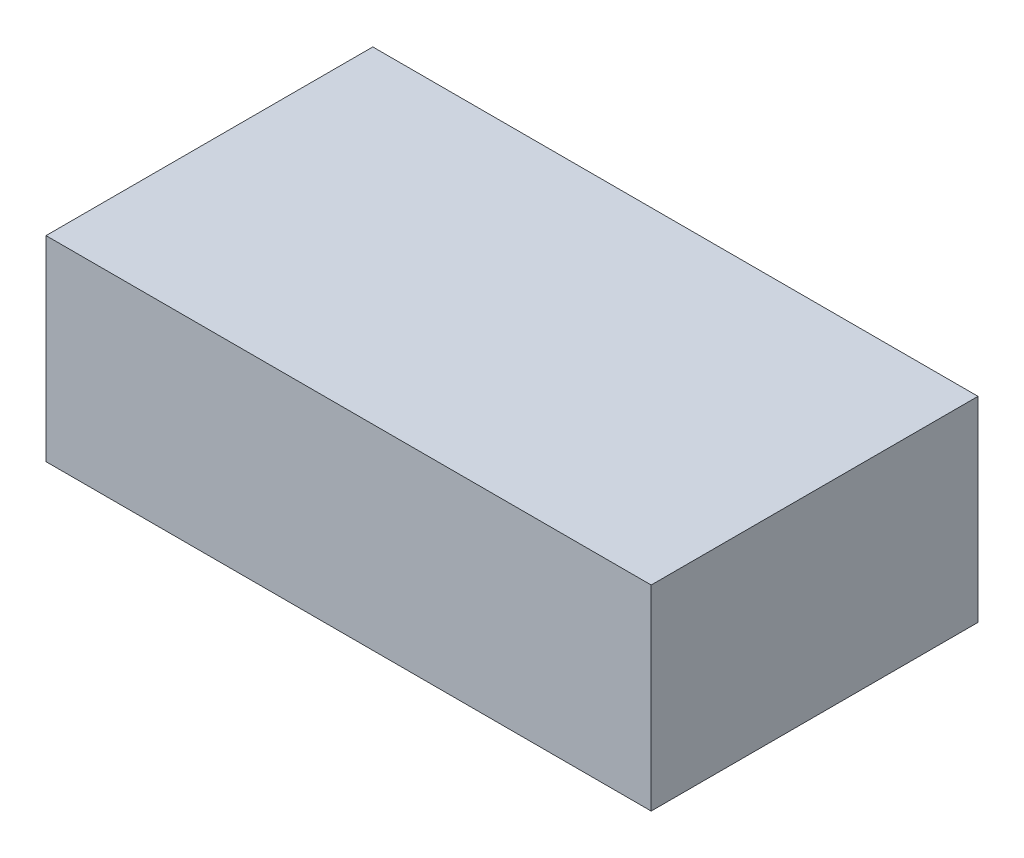
ISO-10303-21;
HEADER;
FILE_DESCRIPTION(('STEP AP214'),'2;1');
FILE_NAME('part.step','',(''),(''),'','','');
FILE_SCHEMA(('AUTOMOTIVE_DESIGN { 1 0 10303 214 1 1 1 1 }'));
ENDSEC;
DATA;
#1=APPLICATION_CONTEXT('core data for automotive mechanical design processes');
#2=APPLICATION_PROTOCOL_DEFINITION('international standard','automotive_design',2000,#1);
#3=PRODUCT_CONTEXT('',#1,'mechanical');
#4=PRODUCT('Part','Part','',(#3));
#5=PRODUCT_RELATED_PRODUCT_CATEGORY('part','',(#4));
#6=PRODUCT_DEFINITION_FORMATION('','',#4);
#7=PRODUCT_DEFINITION_CONTEXT('part definition',#1,'design');
#8=PRODUCT_DEFINITION('design','',#6,#7);
#9=PRODUCT_DEFINITION_SHAPE('','',#8);
#10=(LENGTH_UNIT() NAMED_UNIT(*) SI_UNIT(.MILLI.,.METRE.));
#11=(NAMED_UNIT(*) PLANE_ANGLE_UNIT() SI_UNIT($,.RADIAN.));
#12=(NAMED_UNIT(*) SI_UNIT($,.STERADIAN.) SOLID_ANGLE_UNIT());
#13=UNCERTAINTY_MEASURE_WITH_UNIT(LENGTH_MEASURE(1.E-05),#10,'distance_accuracy_value','');
#14=(GEOMETRIC_REPRESENTATION_CONTEXT(3) GLOBAL_UNCERTAINTY_ASSIGNED_CONTEXT((#13)) GLOBAL_UNIT_ASSIGNED_CONTEXT((#10,
#11,#12)) REPRESENTATION_CONTEXT('',''));
#15=CARTESIAN_POINT('',(0.,0.,0.));
#16=DIRECTION('',(0.,0.,1.));
#17=DIRECTION('',(1.,0.,0.));
#18=AXIS2_PLACEMENT_3D('',#15,#16,#17);
#19=CARTESIAN_POINT('',(-0.42500042,0.13750036,0.45899832));
#20=DIRECTION('',(0.,0.,1.));
#21=DIRECTION('',(1.,0.,0.));
#22=AXIS2_PLACEMENT_3D('',#19,#20,#21);
#23=PLANE('',#22);
#24=DIRECTION('',(1.,0.,0.));
#25=VECTOR('',#24,1.);
#26=CARTESIAN_POINT('',(-0.42500042,0.13750036,0.45899832));
#27=LINE('',#26,#25);
#28=CARTESIAN_POINT('',(-0.42500042,0.13750036,0.45899832));
#29=VERTEX_POINT('',#28);
#30=CARTESIAN_POINT('',(0.42500042,0.13750036,0.45899832));
#31=VERTEX_POINT('',#30);
#32=EDGE_CURVE('E79',#29,#31,#27,.T.);
#33=ORIENTED_EDGE('',*,*,#32,.F.);
#34=DIRECTION('',(0.,1.,0.));
#35=VECTOR('',#34,1.);
#36=CARTESIAN_POINT('',(-0.42500042,-0.13750036,0.45899832));
#37=LINE('',#36,#35);
#38=CARTESIAN_POINT('',(-0.42500042,-0.13750036,0.45899832));
#39=VERTEX_POINT('',#38);
#40=EDGE_CURVE('E27',#39,#29,#37,.T.);
#41=ORIENTED_EDGE('',*,*,#40,.F.);
#42=DIRECTION('',(-1.,0.,0.));
#43=VECTOR('',#42,1.);
#44=CARTESIAN_POINT('',(0.42500042,-0.13750036,0.45899832));
#45=LINE('',#44,#43);
#46=CARTESIAN_POINT('',(0.42500042,-0.13750036,0.45899832));
#47=VERTEX_POINT('',#46);
#48=EDGE_CURVE('E101',#47,#39,#45,.T.);
#49=ORIENTED_EDGE('',*,*,#48,.F.);
#50=DIRECTION('',(0.,-1.,0.));
#51=VECTOR('',#50,1.);
#52=CARTESIAN_POINT('',(0.42500042,0.13750036,0.45899832));
#53=LINE('',#52,#51);
#54=EDGE_CURVE('E81',#31,#47,#53,.T.);
#55=ORIENTED_EDGE('',*,*,#54,.F.);
#56=EDGE_LOOP('',(#33,#41,#49,#55));
#57=FACE_BOUND('',#56,.T.);
#58=ADVANCED_FACE('F17',(#57),#23,.T.);
#59=CARTESIAN_POINT('',(-0.42500042,0.13750036,0.));
#60=DIRECTION('',(0.,0.,1.));
#61=DIRECTION('',(1.,0.,0.));
#62=AXIS2_PLACEMENT_3D('',#59,#60,#61);
#63=PLANE('',#62);
#64=DIRECTION('',(1.,0.,0.));
#65=VECTOR('',#64,1.);
#66=CARTESIAN_POINT('',(-0.42500042,0.13750036,0.));
#67=LINE('',#66,#65);
#68=CARTESIAN_POINT('',(-0.42500042,0.13750036,0.));
#69=VERTEX_POINT('',#68);
#70=CARTESIAN_POINT('',(0.42500042,0.13750036,0.));
#71=VERTEX_POINT('',#70);
#72=EDGE_CURVE('E89',#69,#71,#67,.T.);
#73=ORIENTED_EDGE('',*,*,#72,.T.);
#74=DIRECTION('',(0.,-1.,0.));
#75=VECTOR('',#74,1.);
#76=CARTESIAN_POINT('',(0.42500042,0.13750036,0.));
#77=LINE('',#76,#75);
#78=CARTESIAN_POINT('',(0.42500042,-0.13750036,0.));
#79=VERTEX_POINT('',#78);
#80=EDGE_CURVE('E98',#71,#79,#77,.T.);
#81=ORIENTED_EDGE('',*,*,#80,.T.);
#82=DIRECTION('',(-1.,0.,0.));
#83=VECTOR('',#82,1.);
#84=CARTESIAN_POINT('',(0.42500042,-0.13750036,0.));
#85=LINE('',#84,#83);
#86=CARTESIAN_POINT('',(-0.42500042,-0.13750036,0.));
#87=VERTEX_POINT('',#86);
#88=EDGE_CURVE('E76',#79,#87,#85,.T.);
#89=ORIENTED_EDGE('',*,*,#88,.T.);
#90=DIRECTION('',(0.,1.,0.));
#91=VECTOR('',#90,1.);
#92=CARTESIAN_POINT('',(-0.42500042,-0.13750036,0.));
#93=LINE('',#92,#91);
#94=EDGE_CURVE('E11',#87,#69,#93,.T.);
#95=ORIENTED_EDGE('',*,*,#94,.T.);
#96=EDGE_LOOP('',(#73,#81,#89,#95));
#97=FACE_BOUND('',#96,.T.);
#98=ADVANCED_FACE('F126',(#97),#63,.F.);
#99=CARTESIAN_POINT('',(-0.42500042,-0.13750036,0.));
#100=DIRECTION('',(-1.,0.,0.));
#101=DIRECTION('',(0.,0.,1.));
#102=AXIS2_PLACEMENT_3D('',#99,#100,#101);
#103=PLANE('',#102);
#104=DIRECTION('',(0.,0.,1.));
#105=VECTOR('',#104,1.);
#106=CARTESIAN_POINT('',(-0.42500042,-0.13750036,0.));
#107=LINE('',#106,#105);
#108=EDGE_CURVE('E71',#87,#39,#107,.T.);
#109=ORIENTED_EDGE('',*,*,#108,.T.);
#110=ORIENTED_EDGE('',*,*,#40,.T.);
#111=DIRECTION('',(0.,0.,1.));
#112=VECTOR('',#111,1.);
#113=CARTESIAN_POINT('',(-0.42500042,0.13750036,0.));
#114=LINE('',#113,#112);
#115=EDGE_CURVE('E69',#69,#29,#114,.T.);
#116=ORIENTED_EDGE('',*,*,#115,.F.);
#117=ORIENTED_EDGE('',*,*,#94,.F.);
#118=EDGE_LOOP('',(#109,#110,#116,#117));
#119=FACE_BOUND('',#118,.T.);
#120=ADVANCED_FACE('F67',(#119),#103,.T.);
#121=CARTESIAN_POINT('',(0.42500042,-0.13750036,0.));
#122=DIRECTION('',(0.,-1.,0.));
#123=DIRECTION('',(0.,0.,-1.));
#124=AXIS2_PLACEMENT_3D('',#121,#122,#123);
#125=PLANE('',#124);
#126=DIRECTION('',(0.,0.,1.));
#127=VECTOR('',#126,1.);
#128=CARTESIAN_POINT('',(0.42500042,-0.13750036,0.));
#129=LINE('',#128,#127);
#130=EDGE_CURVE('E102',#79,#47,#129,.T.);
#131=ORIENTED_EDGE('',*,*,#130,.T.);
#132=ORIENTED_EDGE('',*,*,#48,.T.);
#133=ORIENTED_EDGE('',*,*,#108,.F.);
#134=ORIENTED_EDGE('',*,*,#88,.F.);
#135=EDGE_LOOP('',(#131,#132,#133,#134));
#136=FACE_BOUND('',#135,.T.);
#137=ADVANCED_FACE('F135',(#136),#125,.T.);
#138=CARTESIAN_POINT('',(0.42500042,0.13750036,0.));
#139=DIRECTION('',(1.,0.,0.));
#140=DIRECTION('',(0.,1.,0.));
#141=AXIS2_PLACEMENT_3D('',#138,#139,#140);
#142=PLANE('',#141);
#143=DIRECTION('',(0.,0.,1.));
#144=VECTOR('',#143,1.);
#145=CARTESIAN_POINT('',(0.42500042,0.13750036,0.));
#146=LINE('',#145,#144);
#147=EDGE_CURVE('E86',#71,#31,#146,.T.);
#148=ORIENTED_EDGE('',*,*,#147,.T.);
#149=ORIENTED_EDGE('',*,*,#54,.T.);
#150=ORIENTED_EDGE('',*,*,#130,.F.);
#151=ORIENTED_EDGE('',*,*,#80,.F.);
#152=EDGE_LOOP('',(#148,#149,#150,#151));
#153=FACE_BOUND('',#152,.T.);
#154=ADVANCED_FACE('F19',(#153),#142,.T.);
#155=CARTESIAN_POINT('',(-0.42500042,0.13750036,0.));
#156=DIRECTION('',(0.,1.,0.));
#157=DIRECTION('',(1.,0.,0.));
#158=AXIS2_PLACEMENT_3D('',#155,#156,#157);
#159=PLANE('',#158);
#160=ORIENTED_EDGE('',*,*,#115,.T.);
#161=ORIENTED_EDGE('',*,*,#32,.T.);
#162=ORIENTED_EDGE('',*,*,#147,.F.);
#163=ORIENTED_EDGE('',*,*,#72,.F.);
#164=EDGE_LOOP('',(#160,#161,#162,#163));
#165=FACE_BOUND('',#164,.T.);
#166=ADVANCED_FACE('F88',(#165),#159,.T.);
#167=CLOSED_SHELL('',(#58,#98,#120,#137,#154,#166));
#168=MANIFOLD_SOLID_BREP('B1',#167);
#169=ADVANCED_BREP_SHAPE_REPRESENTATION('',(#18,#168),#14);
#170=SHAPE_DEFINITION_REPRESENTATION(#9,#169);
ENDSEC;
END-ISO-10303-21;
